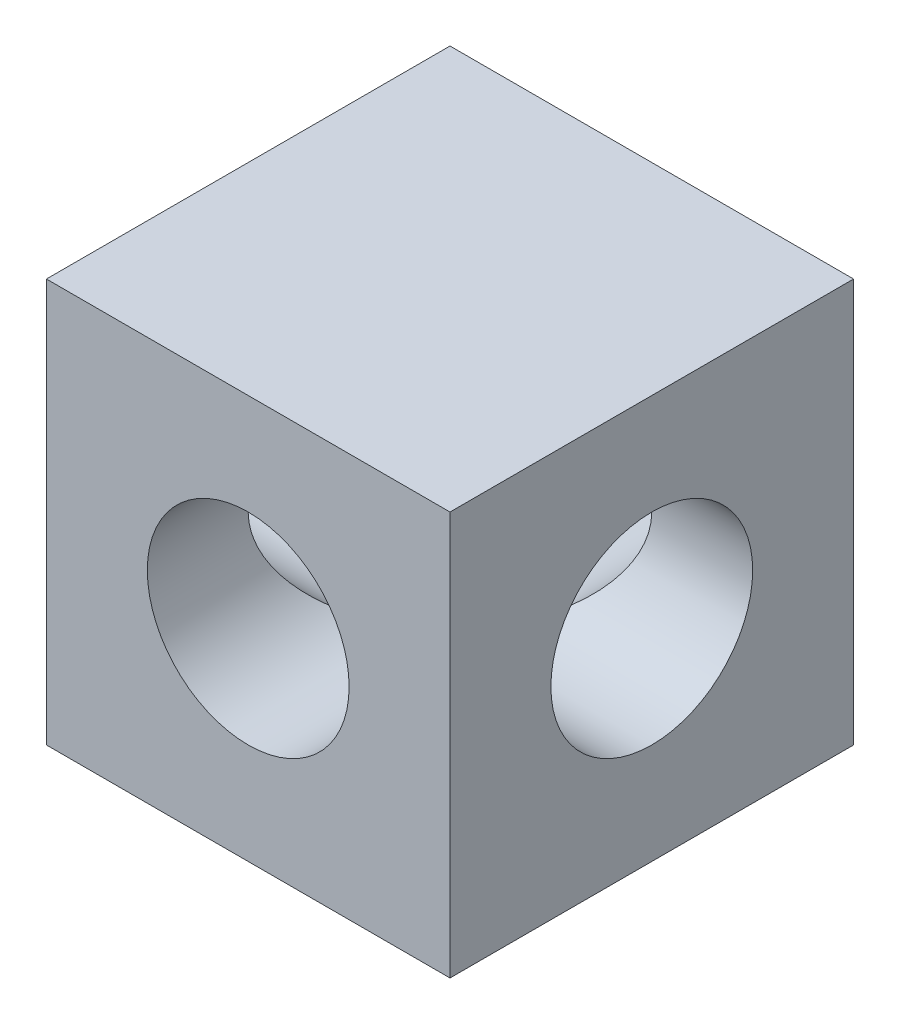
ISO-10303-21;
HEADER;
FILE_DESCRIPTION(('STEP AP214'),'2;1');
FILE_NAME('part.step','',(''),(''),'','','');
FILE_SCHEMA(('AUTOMOTIVE_DESIGN { 1 0 10303 214 1 1 1 1 }'));
ENDSEC;
DATA;
#1=APPLICATION_CONTEXT('core data for automotive mechanical design processes');
#2=APPLICATION_PROTOCOL_DEFINITION('international standard','automotive_design',2000,#1);
#3=PRODUCT_CONTEXT('',#1,'mechanical');
#4=PRODUCT('Part','Part','',(#3));
#5=PRODUCT_RELATED_PRODUCT_CATEGORY('part','',(#4));
#6=PRODUCT_DEFINITION_FORMATION('','',#4);
#7=PRODUCT_DEFINITION_CONTEXT('part definition',#1,'design');
#8=PRODUCT_DEFINITION('design','',#6,#7);
#9=PRODUCT_DEFINITION_SHAPE('','',#8);
#10=(LENGTH_UNIT() NAMED_UNIT(*) SI_UNIT(.MILLI.,.METRE.));
#11=(NAMED_UNIT(*) PLANE_ANGLE_UNIT() SI_UNIT($,.RADIAN.));
#12=(NAMED_UNIT(*) SI_UNIT($,.STERADIAN.) SOLID_ANGLE_UNIT());
#13=UNCERTAINTY_MEASURE_WITH_UNIT(LENGTH_MEASURE(1.E-05),#10,'distance_accuracy_value','');
#14=(GEOMETRIC_REPRESENTATION_CONTEXT(3) GLOBAL_UNCERTAINTY_ASSIGNED_CONTEXT((#13)) GLOBAL_UNIT_ASSIGNED_CONTEXT((#10,
#11,#12)) REPRESENTATION_CONTEXT('',''));
#15=CARTESIAN_POINT('',(0.,0.,0.));
#16=DIRECTION('',(0.,0.,1.));
#17=DIRECTION('',(1.,0.,0.));
#18=AXIS2_PLACEMENT_3D('',#15,#16,#17);
#19=CARTESIAN_POINT('',(2.67316233337547E-05,0.,7.61997326837667));
#20=DIRECTION('',(0.,0.,-1.));
#21=DIRECTION('',(-1.,0.,0.));
#22=AXIS2_PLACEMENT_3D('',#19,#20,#21);
#23=CYLINDRICAL_SURFACE('',#22,3.81);
#24=CARTESIAN_POINT('',(2.67316233337547E-05,0.,-2.67316233355297E-05));
#25=DIRECTION('',(0.707106781186548,0.,-0.707106781186547));
#26=DIRECTION('',(-0.707106781186548,0.,-0.707106781186547));
#27=AXIS2_PLACEMENT_3D('',#24,#25,#26);
#28=ELLIPSE('',#27,5.38815367264149,3.81);
#29=CARTESIAN_POINT('',(2.67316233337547E-05,-3.81,-2.67316233355297E-05));
#30=VERTEX_POINT('',#29);
#31=CARTESIAN_POINT('',(2.67316233337547E-05,3.81,-2.67316233355297E-05));
#32=VERTEX_POINT('',#31);
#33=EDGE_CURVE('E11',#30,#32,#28,.F.);
#34=ORIENTED_EDGE('',*,*,#33,.F.);
#35=CARTESIAN_POINT('',(2.67316233337547E-05,0.,-2.67316233355297E-05));
#36=DIRECTION('',(-0.707106781186548,0.,-0.707106781186547));
#37=DIRECTION('',(0.707106781186548,0.,-0.707106781186547));
#38=AXIS2_PLACEMENT_3D('',#35,#36,#37);
#39=ELLIPSE('',#38,5.38815367264149,3.81);
#40=EDGE_CURVE('E57',#32,#30,#39,.F.);
#41=ORIENTED_EDGE('',*,*,#40,.F.);
#42=EDGE_LOOP('',(#34,#41));
#43=FACE_BOUND('',#42,.T.);
#44=CARTESIAN_POINT('',(2.67316233337547E-05,0.,7.61997326837667));
#45=DIRECTION('',(0.,0.,1.));
#46=DIRECTION('',(1.,0.,0.));
#47=AXIS2_PLACEMENT_3D('',#44,#45,#46);
#48=CIRCLE('',#47,3.81);
#49=CARTESIAN_POINT('',(3.81002673162333,0.,7.61997326837667));
#50=VERTEX_POINT('',#49);
#51=EDGE_CURVE('E145',#50,#50,#48,.T.);
#52=ORIENTED_EDGE('',*,*,#51,.T.);
#53=EDGE_LOOP('',(#52));
#54=FACE_BOUND('',#53,.T.);
#55=ADVANCED_FACE('F42',(#43,#54),#23,.F.);
#56=CARTESIAN_POINT('',(-7.61997326837667,-7.62,7.61997326837667));
#57=DIRECTION('',(0.,0.,-1.));
#58=DIRECTION('',(-1.,0.,0.));
#59=AXIS2_PLACEMENT_3D('',#56,#57,#58);
#60=PLANE('',#59);
#61=DIRECTION('',(0.,1.,0.));
#62=VECTOR('',#61,1.);
#63=CARTESIAN_POINT('',(-7.61997326837667,-7.62,7.61997326837667));
#64=LINE('',#63,#62);
#65=CARTESIAN_POINT('',(-7.61997326837667,-7.62,7.61997326837667));
#66=VERTEX_POINT('',#65);
#67=CARTESIAN_POINT('',(-7.61997326837667,7.62,7.61997326837667));
#68=VERTEX_POINT('',#67);
#69=EDGE_CURVE('E132',#66,#68,#64,.T.);
#70=ORIENTED_EDGE('',*,*,#69,.F.);
#71=DIRECTION('',(1.,0.,0.));
#72=VECTOR('',#71,1.);
#73=CARTESIAN_POINT('',(-7.61997326837667,-7.62,7.61997326837667));
#74=LINE('',#73,#72);
#75=CARTESIAN_POINT('',(7.62002673162334,-7.62,7.61997326837667));
#76=VERTEX_POINT('',#75);
#77=EDGE_CURVE('E121',#66,#76,#74,.T.);
#78=ORIENTED_EDGE('',*,*,#77,.T.);
#79=DIRECTION('',(0.,-1.,0.));
#80=VECTOR('',#79,1.);
#81=CARTESIAN_POINT('',(7.62002673162334,7.62,7.61997326837667));
#82=LINE('',#81,#80);
#83=CARTESIAN_POINT('',(7.62002673162334,7.62,7.61997326837667));
#84=VERTEX_POINT('',#83);
#85=EDGE_CURVE('E148',#84,#76,#82,.T.);
#86=ORIENTED_EDGE('',*,*,#85,.F.);
#87=DIRECTION('',(-1.,0.,0.));
#88=VECTOR('',#87,1.);
#89=CARTESIAN_POINT('',(7.62002673162334,7.62,7.61997326837667));
#90=LINE('',#89,#88);
#91=EDGE_CURVE('E93',#84,#68,#90,.T.);
#92=ORIENTED_EDGE('',*,*,#91,.T.);
#93=EDGE_LOOP('',(#70,#78,#86,#92));
#94=FACE_BOUND('',#93,.T.);
#95=ORIENTED_EDGE('',*,*,#51,.F.);
#96=EDGE_LOOP('',(#95));
#97=FACE_BOUND('',#96,.T.);
#98=ADVANCED_FACE('F181',(#94,#97),#60,.F.);
#99=CARTESIAN_POINT('',(-7.61997326837667,-7.62,-7.62002673162333));
#100=DIRECTION('',(0.,0.,-1.));
#101=DIRECTION('',(-1.,0.,0.));
#102=AXIS2_PLACEMENT_3D('',#99,#100,#101);
#103=PLANE('',#102);
#104=DIRECTION('',(0.,1.,0.));
#105=VECTOR('',#104,1.);
#106=CARTESIAN_POINT('',(-7.61997326837667,-7.62,-7.62002673162333));
#107=LINE('',#106,#105);
#108=CARTESIAN_POINT('',(-7.61997326837667,-7.62,-7.62002673162333));
#109=VERTEX_POINT('',#108);
#110=CARTESIAN_POINT('',(-7.61997326837667,7.62,-7.62002673162333));
#111=VERTEX_POINT('',#110);
#112=EDGE_CURVE('E141',#109,#111,#107,.T.);
#113=ORIENTED_EDGE('',*,*,#112,.T.);
#114=DIRECTION('',(-1.,0.,0.));
#115=VECTOR('',#114,1.);
#116=CARTESIAN_POINT('',(7.62002673162334,7.62,-7.62002673162333));
#117=LINE('',#116,#115);
#118=CARTESIAN_POINT('',(7.62002673162334,7.62,-7.62002673162333));
#119=VERTEX_POINT('',#118);
#120=EDGE_CURVE('E137',#119,#111,#117,.T.);
#121=ORIENTED_EDGE('',*,*,#120,.F.);
#122=DIRECTION('',(0.,-1.,0.));
#123=VECTOR('',#122,1.);
#124=CARTESIAN_POINT('',(7.62002673162334,7.62,-7.62002673162333));
#125=LINE('',#124,#123);
#126=CARTESIAN_POINT('',(7.62002673162334,-7.62,-7.62002673162333));
#127=VERTEX_POINT('',#126);
#128=EDGE_CURVE('E133',#119,#127,#125,.T.);
#129=ORIENTED_EDGE('',*,*,#128,.T.);
#130=DIRECTION('',(1.,0.,0.));
#131=VECTOR('',#130,1.);
#132=CARTESIAN_POINT('',(-7.61997326837667,-7.62,-7.62002673162333));
#133=LINE('',#132,#131);
#134=EDGE_CURVE('E129',#109,#127,#133,.T.);
#135=ORIENTED_EDGE('',*,*,#134,.F.);
#136=EDGE_LOOP('',(#113,#121,#129,#135));
#137=FACE_BOUND('',#136,.T.);
#138=CARTESIAN_POINT('',(2.67316233337547E-05,0.,-7.62002673162333));
#139=DIRECTION('',(0.,0.,1.));
#140=DIRECTION('',(1.,0.,0.));
#141=AXIS2_PLACEMENT_3D('',#138,#139,#140);
#142=CIRCLE('',#141,3.81);
#143=CARTESIAN_POINT('',(3.81002673162333,0.,-7.62002673162333));
#144=VERTEX_POINT('',#143);
#145=EDGE_CURVE('E156',#144,#144,#142,.T.);
#146=ORIENTED_EDGE('',*,*,#145,.T.);
#147=EDGE_LOOP('',(#146));
#148=FACE_BOUND('',#147,.T.);
#149=ADVANCED_FACE('F185',(#137,#148),#103,.T.);
#150=CARTESIAN_POINT('',(-7.61997326837667,-7.62,7.61997326837667));
#151=DIRECTION('',(-1.,0.,0.));
#152=DIRECTION('',(0.,-1.,0.));
#153=AXIS2_PLACEMENT_3D('',#150,#151,#152);
#154=PLANE('',#153);
#155=CARTESIAN_POINT('',(-7.61997326837667,0.,-2.67316233362235E-05));
#156=DIRECTION('',(1.,0.,0.));
#157=DIRECTION('',(0.,0.,-1.));
#158=AXIS2_PLACEMENT_3D('',#155,#156,#157);
#159=CIRCLE('',#158,3.81);
#160=CARTESIAN_POINT('',(-7.61997326837667,0.,-3.81002673162334));
#161=VERTEX_POINT('',#160);
#162=EDGE_CURVE('E160',#161,#161,#159,.T.);
#163=ORIENTED_EDGE('',*,*,#162,.T.);
#164=EDGE_LOOP('',(#163));
#165=FACE_BOUND('',#164,.T.);
#166=ORIENTED_EDGE('',*,*,#112,.F.);
#167=DIRECTION('',(0.,0.,-1.));
#168=VECTOR('',#167,1.);
#169=CARTESIAN_POINT('',(-7.61997326837667,-7.62,7.61997326837667));
#170=LINE('',#169,#168);
#171=EDGE_CURVE('E66',#66,#109,#170,.T.);
#172=ORIENTED_EDGE('',*,*,#171,.F.);
#173=ORIENTED_EDGE('',*,*,#69,.T.);
#174=DIRECTION('',(0.,0.,-1.));
#175=VECTOR('',#174,1.);
#176=CARTESIAN_POINT('',(-7.61997326837667,7.62,7.61997326837667));
#177=LINE('',#176,#175);
#178=EDGE_CURVE('E117',#68,#111,#177,.T.);
#179=ORIENTED_EDGE('',*,*,#178,.T.);
#180=EDGE_LOOP('',(#166,#172,#173,#179));
#181=FACE_BOUND('',#180,.T.);
#182=ADVANCED_FACE('F44',(#165,#181),#154,.T.);
#183=CARTESIAN_POINT('',(-7.61997326837667,-7.62,7.61997326837667));
#184=DIRECTION('',(0.,1.,0.));
#185=DIRECTION('',(-1.,0.,0.));
#186=AXIS2_PLACEMENT_3D('',#183,#184,#185);
#187=PLANE('',#186);
#188=ORIENTED_EDGE('',*,*,#134,.T.);
#189=DIRECTION('',(0.,0.,-1.));
#190=VECTOR('',#189,1.);
#191=CARTESIAN_POINT('',(7.62002673162334,-7.62,7.61997326837667));
#192=LINE('',#191,#190);
#193=EDGE_CURVE('E124',#76,#127,#192,.T.);
#194=ORIENTED_EDGE('',*,*,#193,.F.);
#195=ORIENTED_EDGE('',*,*,#77,.F.);
#196=ORIENTED_EDGE('',*,*,#171,.T.);
#197=EDGE_LOOP('',(#188,#194,#195,#196));
#198=FACE_BOUND('',#197,.T.);
#199=ADVANCED_FACE('F191',(#198),#187,.F.);
#200=CARTESIAN_POINT('',(7.62002673162334,7.62,7.61997326837667));
#201=DIRECTION('',(1.,0.,0.));
#202=DIRECTION('',(0.,1.,0.));
#203=AXIS2_PLACEMENT_3D('',#200,#201,#202);
#204=PLANE('',#203);
#205=CARTESIAN_POINT('',(7.62002673162334,0.,-2.67316233362235E-05));
#206=DIRECTION('',(1.,0.,0.));
#207=DIRECTION('',(0.,0.,-1.));
#208=AXIS2_PLACEMENT_3D('',#205,#206,#207);
#209=CIRCLE('',#208,3.81);
#210=CARTESIAN_POINT('',(7.62002673162334,0.,-3.81002673162334));
#211=VERTEX_POINT('',#210);
#212=EDGE_CURVE('E164',#211,#211,#209,.T.);
#213=ORIENTED_EDGE('',*,*,#212,.F.);
#214=EDGE_LOOP('',(#213));
#215=FACE_BOUND('',#214,.T.);
#216=ORIENTED_EDGE('',*,*,#128,.F.);
#217=DIRECTION('',(0.,0.,-1.));
#218=VECTOR('',#217,1.);
#219=CARTESIAN_POINT('',(7.62002673162334,7.62,7.61997326837667));
#220=LINE('',#219,#218);
#221=EDGE_CURVE('E120',#84,#119,#220,.T.);
#222=ORIENTED_EDGE('',*,*,#221,.F.);
#223=ORIENTED_EDGE('',*,*,#85,.T.);
#224=ORIENTED_EDGE('',*,*,#193,.T.);
#225=EDGE_LOOP('',(#216,#222,#223,#224));
#226=FACE_BOUND('',#225,.T.);
#227=ADVANCED_FACE('F194',(#215,#226),#204,.T.);
#228=CARTESIAN_POINT('',(7.62002673162334,7.62,7.61997326837667));
#229=DIRECTION('',(0.,-1.,0.));
#230=DIRECTION('',(1.,0.,0.));
#231=AXIS2_PLACEMENT_3D('',#228,#229,#230);
#232=PLANE('',#231);
#233=ORIENTED_EDGE('',*,*,#120,.T.);
#234=ORIENTED_EDGE('',*,*,#178,.F.);
#235=ORIENTED_EDGE('',*,*,#91,.F.);
#236=ORIENTED_EDGE('',*,*,#221,.T.);
#237=EDGE_LOOP('',(#233,#234,#235,#236));
#238=FACE_BOUND('',#237,.T.);
#239=ADVANCED_FACE('F178',(#238),#232,.F.);
#240=CARTESIAN_POINT('',(2.67316233337547E-05,0.,-2.67316233355297E-05));
#241=DIRECTION('',(0.707106781186548,0.,-0.707106781186547));
#242=DIRECTION('',(-0.707106781186548,0.,-0.707106781186547));
#243=AXIS2_PLACEMENT_3D('',#240,#241,#242);
#244=ELLIPSE('',#243,5.38815367264149,3.81);
#245=EDGE_CURVE('E51',#30,#32,#244,.T.);
#246=ORIENTED_EDGE('',*,*,#245,.F.);
#247=CARTESIAN_POINT('',(2.67316233337547E-05,0.,-2.67316233355297E-05));
#248=DIRECTION('',(-0.707106781186548,0.,-0.707106781186547));
#249=DIRECTION('',(0.707106781186548,0.,-0.707106781186547));
#250=AXIS2_PLACEMENT_3D('',#247,#248,#249);
#251=ELLIPSE('',#250,5.38815367264149,3.81);
#252=EDGE_CURVE('E100',#32,#30,#251,.T.);
#253=ORIENTED_EDGE('',*,*,#252,.F.);
#254=EDGE_LOOP('',(#246,#253));
#255=FACE_BOUND('',#254,.T.);
#256=ORIENTED_EDGE('',*,*,#145,.F.);
#257=EDGE_LOOP('',(#256));
#258=FACE_BOUND('',#257,.T.);
#259=ADVANCED_FACE('F113',(#255,#258),#23,.F.);
#260=CARTESIAN_POINT('',(-7.61997326837667,0.,-2.67316233362235E-05));
#261=DIRECTION('',(1.,0.,0.));
#262=DIRECTION('',(0.,0.,-1.));
#263=AXIS2_PLACEMENT_3D('',#260,#261,#262);
#264=CYLINDRICAL_SURFACE('',#263,3.81);
#265=ORIENTED_EDGE('',*,*,#245,.T.);
#266=ORIENTED_EDGE('',*,*,#40,.T.);
#267=EDGE_LOOP('',(#265,#266));
#268=FACE_BOUND('',#267,.T.);
#269=ORIENTED_EDGE('',*,*,#162,.F.);
#270=EDGE_LOOP('',(#269));
#271=FACE_BOUND('',#270,.T.);
#272=ADVANCED_FACE('F108',(#268,#271),#264,.F.);
#273=ORIENTED_EDGE('',*,*,#33,.T.);
#274=ORIENTED_EDGE('',*,*,#252,.T.);
#275=EDGE_LOOP('',(#273,#274));
#276=FACE_BOUND('',#275,.T.);
#277=ORIENTED_EDGE('',*,*,#212,.T.);
#278=EDGE_LOOP('',(#277));
#279=FACE_BOUND('',#278,.T.);
#280=ADVANCED_FACE('F101',(#276,#279),#264,.F.);
#281=CLOSED_SHELL('',(#55,#98,#149,#182,#199,#227,#239,#259,#272,#280));
#282=MANIFOLD_SOLID_BREP('B2',#281);
#283=ADVANCED_BREP_SHAPE_REPRESENTATION('',(#18,#282),#14);
#284=SHAPE_DEFINITION_REPRESENTATION(#9,#283);
ENDSEC;
END-ISO-10303-21;
